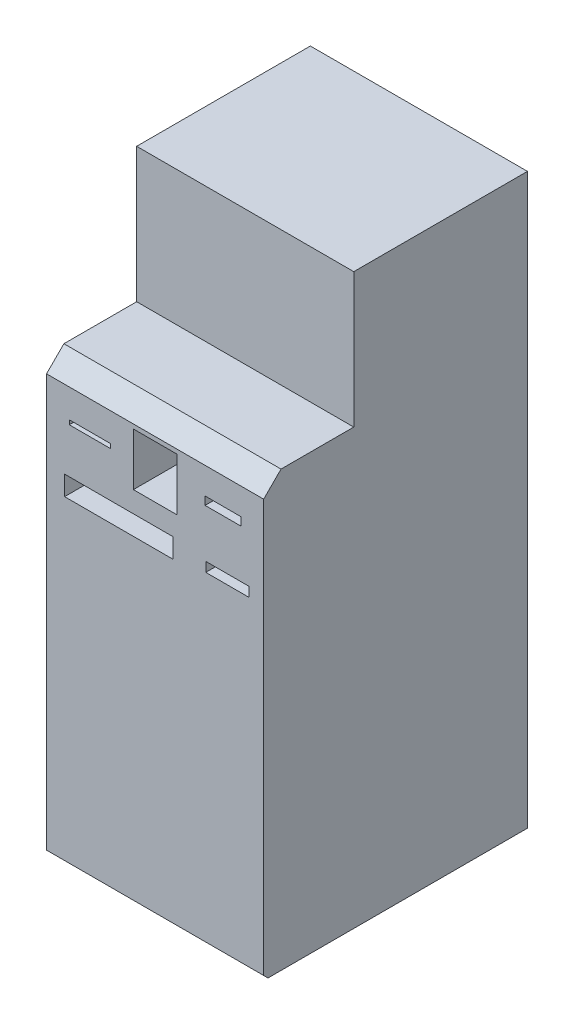
ISO-10303-21;
HEADER;
FILE_DESCRIPTION(('STEP AP214'),'2;1');
FILE_NAME('part.step','',(''),(''),'','','');
FILE_SCHEMA(('AUTOMOTIVE_DESIGN { 1 0 10303 214 1 1 1 1 }'));
ENDSEC;
DATA;
#1=APPLICATION_CONTEXT('core data for automotive mechanical design processes');
#2=APPLICATION_PROTOCOL_DEFINITION('international standard','automotive_design',2000,#1);
#3=PRODUCT_CONTEXT('',#1,'mechanical');
#4=PRODUCT('Part','Part','',(#3));
#5=PRODUCT_RELATED_PRODUCT_CATEGORY('part','',(#4));
#6=PRODUCT_DEFINITION_FORMATION('','',#4);
#7=PRODUCT_DEFINITION_CONTEXT('part definition',#1,'design');
#8=PRODUCT_DEFINITION('design','',#6,#7);
#9=PRODUCT_DEFINITION_SHAPE('','',#8);
#10=(LENGTH_UNIT() NAMED_UNIT(*) SI_UNIT(.MILLI.,.METRE.));
#11=(NAMED_UNIT(*) PLANE_ANGLE_UNIT() SI_UNIT($,.RADIAN.));
#12=(NAMED_UNIT(*) SI_UNIT($,.STERADIAN.) SOLID_ANGLE_UNIT());
#13=UNCERTAINTY_MEASURE_WITH_UNIT(LENGTH_MEASURE(1.E-05),#10,'distance_accuracy_value','');
#14=(GEOMETRIC_REPRESENTATION_CONTEXT(3) GLOBAL_UNCERTAINTY_ASSIGNED_CONTEXT((#13)) GLOBAL_UNIT_ASSIGNED_CONTEXT((#10,
#11,#12)) REPRESENTATION_CONTEXT('',''));
#15=CARTESIAN_POINT('',(0.,0.,0.));
#16=DIRECTION('',(0.,0.,1.));
#17=DIRECTION('',(1.,0.,0.));
#18=AXIS2_PLACEMENT_3D('',#15,#16,#17);
#19=CARTESIAN_POINT('',(500.,1000.,-407.526077778267));
#20=DIRECTION('',(0.,0.,1.));
#21=DIRECTION('',(0.,-1.,0.));
#22=AXIS2_PLACEMENT_3D('',#19,#20,#21);
#23=PLANE('',#22);
#24=DIRECTION('',(0.,1.,0.));
#25=VECTOR('',#24,1.);
#26=CARTESIAN_POINT('',(0.,1000.,-407.526077778267));
#27=LINE('',#26,#25);
#28=CARTESIAN_POINT('',(0.,0.,-407.526077778267));
#29=VERTEX_POINT('',#28);
#30=CARTESIAN_POINT('',(0.,1310.,-407.526077778267));
#31=VERTEX_POINT('',#30);
#32=EDGE_CURVE('E375',#29,#31,#27,.T.);
#33=ORIENTED_EDGE('',*,*,#32,.T.);
#34=DIRECTION('',(-1.,0.,0.));
#35=VECTOR('',#34,1.);
#36=CARTESIAN_POINT('',(500.,1310.,-407.526077778267));
#37=LINE('',#36,#35);
#38=CARTESIAN_POINT('',(500.,1310.,-407.526077778267));
#39=VERTEX_POINT('',#38);
#40=EDGE_CURVE('E40',#39,#31,#37,.T.);
#41=ORIENTED_EDGE('',*,*,#40,.F.);
#42=DIRECTION('',(0.,1.,0.));
#43=VECTOR('',#42,1.);
#44=CARTESIAN_POINT('',(500.,820.,-407.526077778267));
#45=LINE('',#44,#43);
#46=CARTESIAN_POINT('',(500.,0.,-407.526077778267));
#47=VERTEX_POINT('',#46);
#48=EDGE_CURVE('E385',#47,#39,#45,.T.);
#49=ORIENTED_EDGE('',*,*,#48,.F.);
#50=DIRECTION('',(-1.,0.,0.));
#51=VECTOR('',#50,1.);
#52=CARTESIAN_POINT('',(500.,0.,-407.526077778267));
#53=LINE('',#52,#51);
#54=EDGE_CURVE('E11',#47,#29,#53,.T.);
#55=ORIENTED_EDGE('',*,*,#54,.T.);
#56=EDGE_LOOP('',(#33,#41,#49,#55));
#57=FACE_BOUND('',#56,.T.);
#58=ADVANCED_FACE('F33',(#57),#23,.F.);
#59=CARTESIAN_POINT('',(500.,1310.,-7.52607777826703));
#60=DIRECTION('',(0.,-1.,0.));
#61=DIRECTION('',(0.,0.,-1.));
#62=AXIS2_PLACEMENT_3D('',#59,#60,#61);
#63=PLANE('',#62);
#64=DIRECTION('',(0.,0.,1.));
#65=VECTOR('',#64,1.);
#66=CARTESIAN_POINT('',(0.,1310.,-7.52607777826703));
#67=LINE('',#66,#65);
#68=CARTESIAN_POINT('',(0.,1310.,-7.52607777826703));
#69=VERTEX_POINT('',#68);
#70=EDGE_CURVE('E404',#31,#69,#67,.T.);
#71=ORIENTED_EDGE('',*,*,#70,.T.);
#72=DIRECTION('',(-1.,0.,0.));
#73=VECTOR('',#72,1.);
#74=CARTESIAN_POINT('',(500.,1310.,-7.52607777826703));
#75=LINE('',#74,#73);
#76=CARTESIAN_POINT('',(500.,1310.,-7.52607777826703));
#77=VERTEX_POINT('',#76);
#78=EDGE_CURVE('E432',#77,#69,#75,.T.);
#79=ORIENTED_EDGE('',*,*,#78,.F.);
#80=DIRECTION('',(0.,0.,1.));
#81=VECTOR('',#80,1.);
#82=CARTESIAN_POINT('',(500.,1310.,-407.526077778267));
#83=LINE('',#82,#81);
#84=EDGE_CURVE('E388',#39,#77,#83,.T.);
#85=ORIENTED_EDGE('',*,*,#84,.F.);
#86=ORIENTED_EDGE('',*,*,#40,.T.);
#87=EDGE_LOOP('',(#71,#79,#85,#86));
#88=FACE_BOUND('',#87,.T.);
#89=ADVANCED_FACE('F438',(#88),#63,.F.);
#90=CARTESIAN_POINT('',(500.,1000.,-7.52607777826703));
#91=DIRECTION('',(0.,0.,-1.));
#92=DIRECTION('',(-1.,0.,0.));
#93=AXIS2_PLACEMENT_3D('',#90,#91,#92);
#94=PLANE('',#93);
#95=DIRECTION('',(0.,-1.,0.));
#96=VECTOR('',#95,1.);
#97=CARTESIAN_POINT('',(0.,1000.,-7.52607777826703));
#98=LINE('',#97,#96);
#99=CARTESIAN_POINT('',(0.,1000.,-7.52607777826703));
#100=VERTEX_POINT('',#99);
#101=EDGE_CURVE('E406',#69,#100,#98,.T.);
#102=ORIENTED_EDGE('',*,*,#101,.T.);
#103=DIRECTION('',(-1.,0.,0.));
#104=VECTOR('',#103,1.);
#105=CARTESIAN_POINT('',(500.,1000.,-7.52607777826703));
#106=LINE('',#105,#104);
#107=CARTESIAN_POINT('',(500.,1000.,-7.52607777826703));
#108=VERTEX_POINT('',#107);
#109=EDGE_CURVE('E429',#108,#100,#106,.T.);
#110=ORIENTED_EDGE('',*,*,#109,.F.);
#111=DIRECTION('',(0.,-1.,0.));
#112=VECTOR('',#111,1.);
#113=CARTESIAN_POINT('',(500.,1000.,-7.52607777826703));
#114=LINE('',#113,#112);
#115=EDGE_CURVE('E390',#77,#108,#114,.T.);
#116=ORIENTED_EDGE('',*,*,#115,.F.);
#117=ORIENTED_EDGE('',*,*,#78,.T.);
#118=EDGE_LOOP('',(#102,#110,#116,#117));
#119=FACE_BOUND('',#118,.T.);
#120=ADVANCED_FACE('F470',(#119),#94,.F.);
#121=CARTESIAN_POINT('',(500.,1000.,160.));
#122=DIRECTION('',(0.,-1.,0.));
#123=DIRECTION('',(0.,0.,-1.));
#124=AXIS2_PLACEMENT_3D('',#121,#122,#123);
#125=PLANE('',#124);
#126=DIRECTION('',(0.,0.,1.));
#127=VECTOR('',#126,1.);
#128=CARTESIAN_POINT('',(0.,1000.,160.));
#129=LINE('',#128,#127);
#130=CARTESIAN_POINT('',(0.,1000.,160.));
#131=VERTEX_POINT('',#130);
#132=EDGE_CURVE('E408',#100,#131,#129,.T.);
#133=ORIENTED_EDGE('',*,*,#132,.T.);
#134=DIRECTION('',(-1.,0.,0.));
#135=VECTOR('',#134,1.);
#136=CARTESIAN_POINT('',(500.,1000.,160.));
#137=LINE('',#136,#135);
#138=CARTESIAN_POINT('',(500.,1000.,160.));
#139=VERTEX_POINT('',#138);
#140=EDGE_CURVE('E426',#139,#131,#137,.T.);
#141=ORIENTED_EDGE('',*,*,#140,.F.);
#142=DIRECTION('',(0.,0.,1.));
#143=VECTOR('',#142,1.);
#144=CARTESIAN_POINT('',(500.,1000.,160.));
#145=LINE('',#144,#143);
#146=EDGE_CURVE('E392',#108,#139,#145,.T.);
#147=ORIENTED_EDGE('',*,*,#146,.F.);
#148=ORIENTED_EDGE('',*,*,#109,.T.);
#149=EDGE_LOOP('',(#133,#141,#147,#148));
#150=FACE_BOUND('',#149,.T.);
#151=ADVANCED_FACE('F467',(#150),#125,.F.);
#152=CARTESIAN_POINT('',(500.,1000.,160.));
#153=DIRECTION('',(0.,-0.707106781186547,-0.707106781186548));
#154=DIRECTION('',(0.,0.707106781186548,-0.707106781186547));
#155=AXIS2_PLACEMENT_3D('',#152,#153,#154);
#156=PLANE('',#155);
#157=DIRECTION('',(0.,-0.707106781186548,0.707106781186547));
#158=VECTOR('',#157,1.);
#159=CARTESIAN_POINT('',(0.,1000.,160.));
#160=LINE('',#159,#158);
#161=CARTESIAN_POINT('',(0.,960.,200.));
#162=VERTEX_POINT('',#161);
#163=EDGE_CURVE('E410',#131,#162,#160,.T.);
#164=ORIENTED_EDGE('',*,*,#163,.T.);
#165=DIRECTION('',(-1.,0.,0.));
#166=VECTOR('',#165,1.);
#167=CARTESIAN_POINT('',(500.,960.,200.));
#168=LINE('',#167,#166);
#169=CARTESIAN_POINT('',(500.,960.,200.));
#170=VERTEX_POINT('',#169);
#171=EDGE_CURVE('E423',#170,#162,#168,.T.);
#172=ORIENTED_EDGE('',*,*,#171,.F.);
#173=DIRECTION('',(0.,-0.707106781186548,0.707106781186547));
#174=VECTOR('',#173,1.);
#175=CARTESIAN_POINT('',(500.,1000.,160.));
#176=LINE('',#175,#174);
#177=EDGE_CURVE('E394',#139,#170,#176,.T.);
#178=ORIENTED_EDGE('',*,*,#177,.F.);
#179=ORIENTED_EDGE('',*,*,#140,.T.);
#180=EDGE_LOOP('',(#164,#172,#178,#179));
#181=FACE_BOUND('',#180,.T.);
#182=ADVANCED_FACE('F463',(#181),#156,.F.);
#183=CARTESIAN_POINT('',(500.,9.99999999999998,200.));
#184=DIRECTION('',(0.,0.,-1.));
#185=DIRECTION('',(-1.,0.,0.));
#186=AXIS2_PLACEMENT_3D('',#183,#184,#185);
#187=PLANE('',#186);
#188=DIRECTION('',(1.,0.,0.));
#189=VECTOR('',#188,1.);
#190=CARTESIAN_POINT('',(366.666666666667,747.294000625917,200.));
#191=LINE('',#190,#189);
#192=CARTESIAN_POINT('',(366.666666666667,747.294000625917,200.));
#193=VERTEX_POINT('',#192);
#194=CARTESIAN_POINT('',(466.666666666667,747.294000625917,200.));
#195=VERTEX_POINT('',#194);
#196=EDGE_CURVE('E272',#193,#195,#191,.T.);
#197=ORIENTED_EDGE('',*,*,#196,.F.);
#198=DIRECTION('',(0.,-1.,0.));
#199=VECTOR('',#198,1.);
#200=CARTESIAN_POINT('',(366.666666666667,747.294000625917,200.));
#201=LINE('',#200,#199);
#202=CARTESIAN_POINT('',(366.666666666667,769.294000625917,200.));
#203=VERTEX_POINT('',#202);
#204=EDGE_CURVE('E47',#203,#193,#201,.T.);
#205=ORIENTED_EDGE('',*,*,#204,.F.);
#206=DIRECTION('',(-1.,0.,0.));
#207=VECTOR('',#206,1.);
#208=CARTESIAN_POINT('',(366.666666666667,769.294000625917,200.));
#209=LINE('',#208,#207);
#210=CARTESIAN_POINT('',(466.666666666667,769.294000625917,200.));
#211=VERTEX_POINT('',#210);
#212=EDGE_CURVE('E261',#211,#203,#209,.T.);
#213=ORIENTED_EDGE('',*,*,#212,.F.);
#214=DIRECTION('',(0.,1.,0.));
#215=VECTOR('',#214,1.);
#216=CARTESIAN_POINT('',(466.666666666667,747.294000625917,200.));
#217=LINE('',#216,#215);
#218=EDGE_CURVE('E275',#195,#211,#217,.T.);
#219=ORIENTED_EDGE('',*,*,#218,.F.);
#220=EDGE_LOOP('',(#197,#205,#213,#219));
#221=FACE_BOUND('',#220,.T.);
#222=DIRECTION('',(-1.,0.,0.));
#223=VECTOR('',#222,1.);
#224=CARTESIAN_POINT('',(147.65,894.5,200.));
#225=LINE('',#224,#223);
#226=CARTESIAN_POINT('',(147.65,894.5,200.));
#227=VERTEX_POINT('',#226);
#228=CARTESIAN_POINT('',(52.35,894.5,200.));
#229=VERTEX_POINT('',#228);
#230=EDGE_CURVE('E246',#227,#229,#225,.T.);
#231=ORIENTED_EDGE('',*,*,#230,.F.);
#232=DIRECTION('',(0.,1.,0.));
#233=VECTOR('',#232,1.);
#234=CARTESIAN_POINT('',(147.65,894.5,200.));
#235=LINE('',#234,#233);
#236=CARTESIAN_POINT('',(147.65,884.5,200.));
#237=VERTEX_POINT('',#236);
#238=EDGE_CURVE('E55',#237,#227,#235,.T.);
#239=ORIENTED_EDGE('',*,*,#238,.F.);
#240=DIRECTION('',(1.,0.,0.));
#241=VECTOR('',#240,1.);
#242=CARTESIAN_POINT('',(147.65,884.5,200.));
#243=LINE('',#242,#241);
#244=CARTESIAN_POINT('',(52.35,884.5,200.));
#245=VERTEX_POINT('',#244);
#246=EDGE_CURVE('E237',#245,#237,#243,.T.);
#247=ORIENTED_EDGE('',*,*,#246,.F.);
#248=DIRECTION('',(0.,-1.,0.));
#249=VECTOR('',#248,1.);
#250=CARTESIAN_POINT('',(52.35,894.5,200.));
#251=LINE('',#250,#249);
#252=EDGE_CURVE('E240',#229,#245,#251,.T.);
#253=ORIENTED_EDGE('',*,*,#252,.F.);
#254=EDGE_LOOP('',(#231,#239,#247,#253));
#255=FACE_BOUND('',#254,.T.);
#256=DIRECTION('',(1.,0.,0.));
#257=VECTOR('',#256,1.);
#258=CARTESIAN_POINT('',(365.11,880.1,200.));
#259=LINE('',#258,#257);
#260=CARTESIAN_POINT('',(365.11,880.1,200.));
#261=VERTEX_POINT('',#260);
#262=CARTESIAN_POINT('',(447.65,880.1,200.));
#263=VERTEX_POINT('',#262);
#264=EDGE_CURVE('E335',#261,#263,#259,.T.);
#265=ORIENTED_EDGE('',*,*,#264,.F.);
#266=DIRECTION('',(0.,-1.,0.));
#267=VECTOR('',#266,1.);
#268=CARTESIAN_POINT('',(365.11,898.9,200.));
#269=LINE('',#268,#267);
#270=CARTESIAN_POINT('',(365.11,898.9,200.));
#271=VERTEX_POINT('',#270);
#272=EDGE_CURVE('E253',#271,#261,#269,.T.);
#273=ORIENTED_EDGE('',*,*,#272,.F.);
#274=DIRECTION('',(-1.,0.,0.));
#275=VECTOR('',#274,1.);
#276=CARTESIAN_POINT('',(365.11,898.9,200.));
#277=LINE('',#276,#275);
#278=CARTESIAN_POINT('',(447.65,898.9,200.));
#279=VERTEX_POINT('',#278);
#280=EDGE_CURVE('E324',#279,#271,#277,.T.);
#281=ORIENTED_EDGE('',*,*,#280,.F.);
#282=DIRECTION('',(0.,1.,0.));
#283=VECTOR('',#282,1.);
#284=CARTESIAN_POINT('',(447.65,898.9,200.));
#285=LINE('',#284,#283);
#286=EDGE_CURVE('E338',#263,#279,#285,.T.);
#287=ORIENTED_EDGE('',*,*,#286,.F.);
#288=EDGE_LOOP('',(#265,#273,#281,#287));
#289=FACE_BOUND('',#288,.T.);
#290=DIRECTION('',(1.,0.,0.));
#291=VECTOR('',#290,1.);
#292=CARTESIAN_POINT('',(41.6666666666668,735.794000625917,200.));
#293=LINE('',#292,#291);
#294=CARTESIAN_POINT('',(41.6666666666668,735.794000625917,200.));
#295=VERTEX_POINT('',#294);
#296=CARTESIAN_POINT('',(291.666666666667,735.794000625917,200.));
#297=VERTEX_POINT('',#296);
#298=EDGE_CURVE('E302',#295,#297,#293,.T.);
#299=ORIENTED_EDGE('',*,*,#298,.F.);
#300=DIRECTION('',(0.,-1.,0.));
#301=VECTOR('',#300,1.);
#302=CARTESIAN_POINT('',(41.6666666666668,780.794000625917,200.));
#303=LINE('',#302,#301);
#304=CARTESIAN_POINT('',(41.6666666666668,780.794000625917,200.));
#305=VERTEX_POINT('',#304);
#306=EDGE_CURVE('E300',#305,#295,#303,.T.);
#307=ORIENTED_EDGE('',*,*,#306,.F.);
#308=DIRECTION('',(-1.,0.,0.));
#309=VECTOR('',#308,1.);
#310=CARTESIAN_POINT('',(41.6666666666668,780.794000625917,200.));
#311=LINE('',#310,#309);
#312=CARTESIAN_POINT('',(291.666666666667,780.794000625917,200.));
#313=VERTEX_POINT('',#312);
#314=EDGE_CURVE('E290',#313,#305,#311,.T.);
#315=ORIENTED_EDGE('',*,*,#314,.F.);
#316=DIRECTION('',(0.,1.,0.));
#317=VECTOR('',#316,1.);
#318=CARTESIAN_POINT('',(291.666666666667,780.794000625917,200.));
#319=LINE('',#318,#317);
#320=EDGE_CURVE('E306',#297,#313,#319,.T.);
#321=ORIENTED_EDGE('',*,*,#320,.F.);
#322=EDGE_LOOP('',(#299,#307,#315,#321));
#323=FACE_BOUND('',#322,.T.);
#324=DIRECTION('',(1.,0.,0.));
#325=VECTOR('',#324,1.);
#326=CARTESIAN_POINT('',(200.,829.,200.));
#327=LINE('',#326,#325);
#328=CARTESIAN_POINT('',(200.,829.,200.));
#329=VERTEX_POINT('',#328);
#330=CARTESIAN_POINT('',(300.,829.,200.));
#331=VERTEX_POINT('',#330);
#332=EDGE_CURVE('E365',#329,#331,#327,.T.);
#333=ORIENTED_EDGE('',*,*,#332,.F.);
#334=DIRECTION('',(0.,-1.,0.));
#335=VECTOR('',#334,1.);
#336=CARTESIAN_POINT('',(200.,950.,200.));
#337=LINE('',#336,#335);
#338=CARTESIAN_POINT('',(200.,950.,200.));
#339=VERTEX_POINT('',#338);
#340=EDGE_CURVE('E313',#339,#329,#337,.T.);
#341=ORIENTED_EDGE('',*,*,#340,.F.);
#342=DIRECTION('',(-1.,0.,0.));
#343=VECTOR('',#342,1.);
#344=CARTESIAN_POINT('',(200.,950.,200.));
#345=LINE('',#344,#343);
#346=CARTESIAN_POINT('',(300.,950.,200.));
#347=VERTEX_POINT('',#346);
#348=EDGE_CURVE('E354',#347,#339,#345,.T.);
#349=ORIENTED_EDGE('',*,*,#348,.F.);
#350=DIRECTION('',(0.,1.,0.));
#351=VECTOR('',#350,1.);
#352=CARTESIAN_POINT('',(300.,950.,200.));
#353=LINE('',#352,#351);
#354=EDGE_CURVE('E368',#331,#347,#353,.T.);
#355=ORIENTED_EDGE('',*,*,#354,.F.);
#356=EDGE_LOOP('',(#333,#341,#349,#355));
#357=FACE_BOUND('',#356,.T.);
#358=DIRECTION('',(0.,-1.,0.));
#359=VECTOR('',#358,1.);
#360=CARTESIAN_POINT('',(0.,9.99999999999998,200.));
#361=LINE('',#360,#359);
#362=CARTESIAN_POINT('',(0.,9.99999999999998,200.));
#363=VERTEX_POINT('',#362);
#364=EDGE_CURVE('E412',#162,#363,#361,.T.);
#365=ORIENTED_EDGE('',*,*,#364,.T.);
#366=DIRECTION('',(-1.,0.,0.));
#367=VECTOR('',#366,1.);
#368=CARTESIAN_POINT('',(500.,9.99999999999998,200.));
#369=LINE('',#368,#367);
#370=CARTESIAN_POINT('',(500.,9.99999999999998,200.));
#371=VERTEX_POINT('',#370);
#372=EDGE_CURVE('E420',#371,#363,#369,.T.);
#373=ORIENTED_EDGE('',*,*,#372,.F.);
#374=DIRECTION('',(0.,-1.,0.));
#375=VECTOR('',#374,1.);
#376=CARTESIAN_POINT('',(500.,9.99999999999998,200.));
#377=LINE('',#376,#375);
#378=EDGE_CURVE('E396',#170,#371,#377,.T.);
#379=ORIENTED_EDGE('',*,*,#378,.F.);
#380=ORIENTED_EDGE('',*,*,#171,.T.);
#381=EDGE_LOOP('',(#365,#373,#379,#380));
#382=FACE_BOUND('',#381,.T.);
#383=ADVANCED_FACE('F458',(#221,#255,#289,#323,#357,#382),#187,.F.);
#384=CARTESIAN_POINT('',(500.,0.,190.));
#385=DIRECTION('',(0.,0.707106781186548,-0.707106781186547));
#386=DIRECTION('',(0.,0.707106781186547,0.707106781186548));
#387=AXIS2_PLACEMENT_3D('',#384,#385,#386);
#388=PLANE('',#387);
#389=DIRECTION('',(0.,-0.707106781186547,-0.707106781186548));
#390=VECTOR('',#389,1.);
#391=CARTESIAN_POINT('',(0.,0.,190.));
#392=LINE('',#391,#390);
#393=CARTESIAN_POINT('',(0.,0.,190.));
#394=VERTEX_POINT('',#393);
#395=EDGE_CURVE('E414',#363,#394,#392,.T.);
#396=ORIENTED_EDGE('',*,*,#395,.T.);
#397=DIRECTION('',(-1.,0.,0.));
#398=VECTOR('',#397,1.);
#399=CARTESIAN_POINT('',(500.,0.,190.));
#400=LINE('',#399,#398);
#401=CARTESIAN_POINT('',(500.,0.,190.));
#402=VERTEX_POINT('',#401);
#403=EDGE_CURVE('E401',#402,#394,#400,.T.);
#404=ORIENTED_EDGE('',*,*,#403,.F.);
#405=DIRECTION('',(0.,-0.707106781186547,-0.707106781186548));
#406=VECTOR('',#405,1.);
#407=CARTESIAN_POINT('',(500.,0.,190.));
#408=LINE('',#407,#406);
#409=EDGE_CURVE('E398',#371,#402,#408,.T.);
#410=ORIENTED_EDGE('',*,*,#409,.F.);
#411=ORIENTED_EDGE('',*,*,#372,.T.);
#412=EDGE_LOOP('',(#396,#404,#410,#411));
#413=FACE_BOUND('',#412,.T.);
#414=ADVANCED_FACE('F452',(#413),#388,.F.);
#415=CARTESIAN_POINT('',(500.,0.,0.));
#416=DIRECTION('',(0.,1.,0.));
#417=DIRECTION('',(0.,0.,1.));
#418=AXIS2_PLACEMENT_3D('',#415,#416,#417);
#419=PLANE('',#418);
#420=DIRECTION('',(0.,0.,-1.));
#421=VECTOR('',#420,1.);
#422=CARTESIAN_POINT('',(0.,0.,0.));
#423=LINE('',#422,#421);
#424=EDGE_CURVE('E386',#394,#29,#423,.T.);
#425=ORIENTED_EDGE('',*,*,#424,.T.);
#426=ORIENTED_EDGE('',*,*,#54,.F.);
#427=DIRECTION('',(0.,0.,-1.));
#428=VECTOR('',#427,1.);
#429=CARTESIAN_POINT('',(500.,0.,-407.526077778267));
#430=LINE('',#429,#428);
#431=EDGE_CURVE('E382',#402,#47,#430,.T.);
#432=ORIENTED_EDGE('',*,*,#431,.F.);
#433=ORIENTED_EDGE('',*,*,#403,.T.);
#434=EDGE_LOOP('',(#425,#426,#432,#433));
#435=FACE_BOUND('',#434,.T.);
#436=ADVANCED_FACE('F448',(#435),#419,.F.);
#437=CARTESIAN_POINT('',(500.,0.,0.));
#438=DIRECTION('',(-1.,0.,0.));
#439=DIRECTION('',(0.,0.,1.));
#440=AXIS2_PLACEMENT_3D('',#437,#438,#439);
#441=PLANE('',#440);
#442=ORIENTED_EDGE('',*,*,#431,.T.);
#443=ORIENTED_EDGE('',*,*,#48,.T.);
#444=ORIENTED_EDGE('',*,*,#84,.T.);
#445=ORIENTED_EDGE('',*,*,#115,.T.);
#446=ORIENTED_EDGE('',*,*,#146,.T.);
#447=ORIENTED_EDGE('',*,*,#177,.T.);
#448=ORIENTED_EDGE('',*,*,#378,.T.);
#449=ORIENTED_EDGE('',*,*,#409,.T.);
#450=EDGE_LOOP('',(#442,#443,#444,#445,#446,#447,#448,#449));
#451=FACE_BOUND('',#450,.T.);
#452=ADVANCED_FACE('F473',(#451),#441,.F.);
#453=CARTESIAN_POINT('',(0.,0.,0.));
#454=DIRECTION('',(-1.,0.,0.));
#455=DIRECTION('',(0.,0.,1.));
#456=AXIS2_PLACEMENT_3D('',#453,#454,#455);
#457=PLANE('',#456);
#458=ORIENTED_EDGE('',*,*,#32,.F.);
#459=ORIENTED_EDGE('',*,*,#424,.F.);
#460=ORIENTED_EDGE('',*,*,#395,.F.);
#461=ORIENTED_EDGE('',*,*,#364,.F.);
#462=ORIENTED_EDGE('',*,*,#163,.F.);
#463=ORIENTED_EDGE('',*,*,#132,.F.);
#464=ORIENTED_EDGE('',*,*,#101,.F.);
#465=ORIENTED_EDGE('',*,*,#70,.F.);
#466=EDGE_LOOP('',(#458,#459,#460,#461,#462,#463,#464,#465));
#467=FACE_BOUND('',#466,.T.);
#468=ADVANCED_FACE('F444',(#467),#457,.T.);
#469=CARTESIAN_POINT('',(200.,950.,-68.0000000000001));
#470=DIRECTION('',(-1.,0.,0.));
#471=DIRECTION('',(0.,0.,1.));
#472=AXIS2_PLACEMENT_3D('',#469,#470,#471);
#473=PLANE('',#472);
#474=ORIENTED_EDGE('',*,*,#340,.T.);
#475=DIRECTION('',(0.,0.,1.));
#476=VECTOR('',#475,1.);
#477=CARTESIAN_POINT('',(200.,829.,-68.0000000000001));
#478=LINE('',#477,#476);
#479=CARTESIAN_POINT('',(200.,829.,-68.0000000000001));
#480=VERTEX_POINT('',#479);
#481=EDGE_CURVE('E363',#480,#329,#478,.T.);
#482=ORIENTED_EDGE('',*,*,#481,.F.);
#483=DIRECTION('',(0.,-1.,0.));
#484=VECTOR('',#483,1.);
#485=CARTESIAN_POINT('',(200.,950.,-68.0000000000001));
#486=LINE('',#485,#484);
#487=CARTESIAN_POINT('',(200.,950.,-68.0000000000001));
#488=VERTEX_POINT('',#487);
#489=EDGE_CURVE('E350',#488,#480,#486,.T.);
#490=ORIENTED_EDGE('',*,*,#489,.F.);
#491=DIRECTION('',(0.,0.,1.));
#492=VECTOR('',#491,1.);
#493=CARTESIAN_POINT('',(200.,950.,-68.0000000000001));
#494=LINE('',#493,#492);
#495=EDGE_CURVE('E373',#488,#339,#494,.T.);
#496=ORIENTED_EDGE('',*,*,#495,.T.);
#497=EDGE_LOOP('',(#474,#482,#490,#496));
#498=FACE_BOUND('',#497,.T.);
#499=ADVANCED_FACE('F480',(#498),#473,.F.);
#500=CARTESIAN_POINT('',(200.,950.,-68.0000000000001));
#501=DIRECTION('',(0.,1.,0.));
#502=DIRECTION('',(0.,0.,1.));
#503=AXIS2_PLACEMENT_3D('',#500,#501,#502);
#504=PLANE('',#503);
#505=ORIENTED_EDGE('',*,*,#348,.T.);
#506=ORIENTED_EDGE('',*,*,#495,.F.);
#507=DIRECTION('',(-1.,0.,0.));
#508=VECTOR('',#507,1.);
#509=CARTESIAN_POINT('',(200.,950.,-68.0000000000001));
#510=LINE('',#509,#508);
#511=CARTESIAN_POINT('',(300.,950.,-68.0000000000001));
#512=VERTEX_POINT('',#511);
#513=EDGE_CURVE('E360',#512,#488,#510,.T.);
#514=ORIENTED_EDGE('',*,*,#513,.F.);
#515=DIRECTION('',(0.,0.,1.));
#516=VECTOR('',#515,1.);
#517=CARTESIAN_POINT('',(300.,950.,-68.0000000000001));
#518=LINE('',#517,#516);
#519=EDGE_CURVE('E376',#512,#347,#518,.T.);
#520=ORIENTED_EDGE('',*,*,#519,.T.);
#521=EDGE_LOOP('',(#505,#506,#514,#520));
#522=FACE_BOUND('',#521,.T.);
#523=ADVANCED_FACE('F535',(#522),#504,.F.);
#524=CARTESIAN_POINT('',(300.,950.,-68.0000000000001));
#525=DIRECTION('',(1.,0.,0.));
#526=DIRECTION('',(0.,1.,0.));
#527=AXIS2_PLACEMENT_3D('',#524,#525,#526);
#528=PLANE('',#527);
#529=ORIENTED_EDGE('',*,*,#354,.T.);
#530=ORIENTED_EDGE('',*,*,#519,.F.);
#531=DIRECTION('',(0.,1.,0.));
#532=VECTOR('',#531,1.);
#533=CARTESIAN_POINT('',(300.,950.,-68.0000000000001));
#534=LINE('',#533,#532);
#535=CARTESIAN_POINT('',(300.,829.,-68.0000000000001));
#536=VERTEX_POINT('',#535);
#537=EDGE_CURVE('E357',#536,#512,#534,.T.);
#538=ORIENTED_EDGE('',*,*,#537,.F.);
#539=DIRECTION('',(0.,0.,1.));
#540=VECTOR('',#539,1.);
#541=CARTESIAN_POINT('',(300.,829.,-68.0000000000001));
#542=LINE('',#541,#540);
#543=EDGE_CURVE('E378',#536,#331,#542,.T.);
#544=ORIENTED_EDGE('',*,*,#543,.T.);
#545=EDGE_LOOP('',(#529,#530,#538,#544));
#546=FACE_BOUND('',#545,.T.);
#547=ADVANCED_FACE('F544',(#546),#528,.F.);
#548=CARTESIAN_POINT('',(200.,829.,-68.0000000000001));
#549=DIRECTION('',(0.,-1.,0.));
#550=DIRECTION('',(0.,0.,-1.));
#551=AXIS2_PLACEMENT_3D('',#548,#549,#550);
#552=PLANE('',#551);
#553=ORIENTED_EDGE('',*,*,#332,.T.);
#554=ORIENTED_EDGE('',*,*,#543,.F.);
#555=DIRECTION('',(1.,0.,0.));
#556=VECTOR('',#555,1.);
#557=CARTESIAN_POINT('',(200.,829.,-68.0000000000001));
#558=LINE('',#557,#556);
#559=EDGE_CURVE('E353',#480,#536,#558,.T.);
#560=ORIENTED_EDGE('',*,*,#559,.F.);
#561=ORIENTED_EDGE('',*,*,#481,.T.);
#562=EDGE_LOOP('',(#553,#554,#560,#561));
#563=FACE_BOUND('',#562,.T.);
#564=ADVANCED_FACE('F554',(#563),#552,.F.);
#565=CARTESIAN_POINT('',(0.,0.,-68.0000000000001));
#566=DIRECTION('',(0.,0.,1.));
#567=DIRECTION('',(1.,0.,0.));
#568=AXIS2_PLACEMENT_3D('',#565,#566,#567);
#569=PLANE('',#568);
#570=ORIENTED_EDGE('',*,*,#489,.T.);
#571=ORIENTED_EDGE('',*,*,#559,.T.);
#572=ORIENTED_EDGE('',*,*,#537,.T.);
#573=ORIENTED_EDGE('',*,*,#513,.T.);
#574=EDGE_LOOP('',(#570,#571,#572,#573));
#575=FACE_BOUND('',#574,.T.);
#576=ADVANCED_FACE('F564',(#575),#569,.T.);
#577=CARTESIAN_POINT('',(41.6666666666668,780.794000625917,-68.0000000000001));
#578=DIRECTION('',(-1.,0.,0.));
#579=DIRECTION('',(0.,0.,1.));
#580=AXIS2_PLACEMENT_3D('',#577,#578,#579);
#581=PLANE('',#580);
#582=ORIENTED_EDGE('',*,*,#306,.T.);
#583=DIRECTION('',(0.,0.,1.));
#584=VECTOR('',#583,1.);
#585=CARTESIAN_POINT('',(41.6666666666668,735.794000625917,-68.0000000000001));
#586=LINE('',#585,#584);
#587=CARTESIAN_POINT('',(41.6666666666668,735.794000625917,-68.0000000000001));
#588=VERTEX_POINT('',#587);
#589=EDGE_CURVE('E299',#588,#295,#586,.T.);
#590=ORIENTED_EDGE('',*,*,#589,.F.);
#591=DIRECTION('',(0.,-1.,0.));
#592=VECTOR('',#591,1.);
#593=CARTESIAN_POINT('',(41.6666666666668,780.794000625917,-68.0000000000001));
#594=LINE('',#593,#592);
#595=CARTESIAN_POINT('',(41.6666666666668,780.794000625917,-68.0000000000001));
#596=VERTEX_POINT('',#595);
#597=EDGE_CURVE('E286',#596,#588,#594,.T.);
#598=ORIENTED_EDGE('',*,*,#597,.F.);
#599=DIRECTION('',(0.,0.,1.));
#600=VECTOR('',#599,1.);
#601=CARTESIAN_POINT('',(41.6666666666668,780.794000625917,-68.0000000000001));
#602=LINE('',#601,#600);
#603=EDGE_CURVE('E311',#596,#305,#602,.T.);
#604=ORIENTED_EDGE('',*,*,#603,.T.);
#605=EDGE_LOOP('',(#582,#590,#598,#604));
#606=FACE_BOUND('',#605,.T.);
#607=ADVANCED_FACE('F574',(#606),#581,.F.);
#608=CARTESIAN_POINT('',(41.6666666666668,780.794000625917,-68.0000000000001));
#609=DIRECTION('',(0.,1.,0.));
#610=DIRECTION('',(-1.,0.,0.));
#611=AXIS2_PLACEMENT_3D('',#608,#609,#610);
#612=PLANE('',#611);
#613=ORIENTED_EDGE('',*,*,#314,.T.);
#614=ORIENTED_EDGE('',*,*,#603,.F.);
#615=DIRECTION('',(-1.,0.,0.));
#616=VECTOR('',#615,1.);
#617=CARTESIAN_POINT('',(41.6666666666668,780.794000625917,-68.0000000000001));
#618=LINE('',#617,#616);
#619=CARTESIAN_POINT('',(291.666666666667,780.794000625917,-68.0000000000001));
#620=VERTEX_POINT('',#619);
#621=EDGE_CURVE('E296',#620,#596,#618,.T.);
#622=ORIENTED_EDGE('',*,*,#621,.F.);
#623=DIRECTION('',(0.,0.,1.));
#624=VECTOR('',#623,1.);
#625=CARTESIAN_POINT('',(291.666666666667,780.794000625917,-68.0000000000001));
#626=LINE('',#625,#624);
#627=EDGE_CURVE('E314',#620,#313,#626,.T.);
#628=ORIENTED_EDGE('',*,*,#627,.T.);
#629=EDGE_LOOP('',(#613,#614,#622,#628));
#630=FACE_BOUND('',#629,.T.);
#631=ADVANCED_FACE('F584',(#630),#612,.F.);
#632=CARTESIAN_POINT('',(291.666666666667,780.794000625917,-68.0000000000001));
#633=DIRECTION('',(1.,0.,0.));
#634=DIRECTION('',(0.,0.,-1.));
#635=AXIS2_PLACEMENT_3D('',#632,#633,#634);
#636=PLANE('',#635);
#637=ORIENTED_EDGE('',*,*,#320,.T.);
#638=ORIENTED_EDGE('',*,*,#627,.F.);
#639=DIRECTION('',(0.,1.,0.));
#640=VECTOR('',#639,1.);
#641=CARTESIAN_POINT('',(291.666666666667,780.794000625917,-68.0000000000001));
#642=LINE('',#641,#640);
#643=CARTESIAN_POINT('',(291.666666666667,735.794000625917,-68.0000000000001));
#644=VERTEX_POINT('',#643);
#645=EDGE_CURVE('E293',#644,#620,#642,.T.);
#646=ORIENTED_EDGE('',*,*,#645,.F.);
#647=DIRECTION('',(0.,0.,1.));
#648=VECTOR('',#647,1.);
#649=CARTESIAN_POINT('',(291.666666666667,735.794000625917,-68.0000000000001));
#650=LINE('',#649,#648);
#651=EDGE_CURVE('E316',#644,#297,#650,.T.);
#652=ORIENTED_EDGE('',*,*,#651,.T.);
#653=EDGE_LOOP('',(#637,#638,#646,#652));
#654=FACE_BOUND('',#653,.T.);
#655=ADVANCED_FACE('F594',(#654),#636,.F.);
#656=CARTESIAN_POINT('',(41.6666666666668,735.794000625917,-68.0000000000001));
#657=DIRECTION('',(0.,-1.,0.));
#658=DIRECTION('',(1.,0.,0.));
#659=AXIS2_PLACEMENT_3D('',#656,#657,#658);
#660=PLANE('',#659);
#661=ORIENTED_EDGE('',*,*,#298,.T.);
#662=ORIENTED_EDGE('',*,*,#651,.F.);
#663=DIRECTION('',(1.,0.,0.));
#664=VECTOR('',#663,1.);
#665=CARTESIAN_POINT('',(41.6666666666668,735.794000625917,-68.0000000000001));
#666=LINE('',#665,#664);
#667=EDGE_CURVE('E289',#588,#644,#666,.T.);
#668=ORIENTED_EDGE('',*,*,#667,.F.);
#669=ORIENTED_EDGE('',*,*,#589,.T.);
#670=EDGE_LOOP('',(#661,#662,#668,#669));
#671=FACE_BOUND('',#670,.T.);
#672=ADVANCED_FACE('F604',(#671),#660,.F.);
#673=CARTESIAN_POINT('',(0.,0.,-68.0000000000001));
#674=DIRECTION('',(0.,0.,1.));
#675=DIRECTION('',(1.,0.,0.));
#676=AXIS2_PLACEMENT_3D('',#673,#674,#675);
#677=PLANE('',#676);
#678=ORIENTED_EDGE('',*,*,#597,.T.);
#679=ORIENTED_EDGE('',*,*,#667,.T.);
#680=ORIENTED_EDGE('',*,*,#645,.T.);
#681=ORIENTED_EDGE('',*,*,#621,.T.);
#682=EDGE_LOOP('',(#678,#679,#680,#681));
#683=FACE_BOUND('',#682,.T.);
#684=ADVANCED_FACE('F614',(#683),#677,.T.);
#685=CARTESIAN_POINT('',(365.11,898.9,-68.0000000000001));
#686=DIRECTION('',(-1.,0.,0.));
#687=DIRECTION('',(0.,0.,1.));
#688=AXIS2_PLACEMENT_3D('',#685,#686,#687);
#689=PLANE('',#688);
#690=ORIENTED_EDGE('',*,*,#272,.T.);
#691=DIRECTION('',(0.,0.,1.));
#692=VECTOR('',#691,1.);
#693=CARTESIAN_POINT('',(365.11,880.1,-68.0000000000001));
#694=LINE('',#693,#692);
#695=CARTESIAN_POINT('',(365.11,880.1,-68.0000000000001));
#696=VERTEX_POINT('',#695);
#697=EDGE_CURVE('E333',#696,#261,#694,.T.);
#698=ORIENTED_EDGE('',*,*,#697,.F.);
#699=DIRECTION('',(0.,-1.,0.));
#700=VECTOR('',#699,1.);
#701=CARTESIAN_POINT('',(365.11,898.9,-68.0000000000001));
#702=LINE('',#701,#700);
#703=CARTESIAN_POINT('',(365.11,898.9,-68.0000000000001));
#704=VERTEX_POINT('',#703);
#705=EDGE_CURVE('E320',#704,#696,#702,.T.);
#706=ORIENTED_EDGE('',*,*,#705,.F.);
#707=DIRECTION('',(0.,0.,1.));
#708=VECTOR('',#707,1.);
#709=CARTESIAN_POINT('',(365.11,898.9,-68.0000000000001));
#710=LINE('',#709,#708);
#711=EDGE_CURVE('E303',#704,#271,#710,.T.);
#712=ORIENTED_EDGE('',*,*,#711,.T.);
#713=EDGE_LOOP('',(#690,#698,#706,#712));
#714=FACE_BOUND('',#713,.T.);
#715=ADVANCED_FACE('F624',(#714),#689,.F.);
#716=CARTESIAN_POINT('',(365.11,898.9,-68.0000000000001));
#717=DIRECTION('',(0.,1.,0.));
#718=DIRECTION('',(-1.,0.,0.));
#719=AXIS2_PLACEMENT_3D('',#716,#717,#718);
#720=PLANE('',#719);
#721=ORIENTED_EDGE('',*,*,#280,.T.);
#722=ORIENTED_EDGE('',*,*,#711,.F.);
#723=DIRECTION('',(-1.,0.,0.));
#724=VECTOR('',#723,1.);
#725=CARTESIAN_POINT('',(365.11,898.9,-68.0000000000001));
#726=LINE('',#725,#724);
#727=CARTESIAN_POINT('',(447.65,898.9,-68.0000000000001));
#728=VERTEX_POINT('',#727);
#729=EDGE_CURVE('E330',#728,#704,#726,.T.);
#730=ORIENTED_EDGE('',*,*,#729,.F.);
#731=DIRECTION('',(0.,0.,1.));
#732=VECTOR('',#731,1.);
#733=CARTESIAN_POINT('',(447.65,898.9,-68.0000000000001));
#734=LINE('',#733,#732);
#735=EDGE_CURVE('E344',#728,#279,#734,.T.);
#736=ORIENTED_EDGE('',*,*,#735,.T.);
#737=EDGE_LOOP('',(#721,#722,#730,#736));
#738=FACE_BOUND('',#737,.T.);
#739=ADVANCED_FACE('F634',(#738),#720,.F.);
#740=CARTESIAN_POINT('',(447.65,898.9,-68.0000000000001));
#741=DIRECTION('',(1.,0.,0.));
#742=DIRECTION('',(0.,0.,-1.));
#743=AXIS2_PLACEMENT_3D('',#740,#741,#742);
#744=PLANE('',#743);
#745=ORIENTED_EDGE('',*,*,#286,.T.);
#746=ORIENTED_EDGE('',*,*,#735,.F.);
#747=DIRECTION('',(0.,1.,0.));
#748=VECTOR('',#747,1.);
#749=CARTESIAN_POINT('',(447.65,898.9,-68.0000000000001));
#750=LINE('',#749,#748);
#751=CARTESIAN_POINT('',(447.65,880.1,-68.0000000000001));
#752=VERTEX_POINT('',#751);
#753=EDGE_CURVE('E327',#752,#728,#750,.T.);
#754=ORIENTED_EDGE('',*,*,#753,.F.);
#755=DIRECTION('',(0.,0.,1.));
#756=VECTOR('',#755,1.);
#757=CARTESIAN_POINT('',(447.65,880.1,-68.0000000000001));
#758=LINE('',#757,#756);
#759=EDGE_CURVE('E346',#752,#263,#758,.T.);
#760=ORIENTED_EDGE('',*,*,#759,.T.);
#761=EDGE_LOOP('',(#745,#746,#754,#760));
#762=FACE_BOUND('',#761,.T.);
#763=ADVANCED_FACE('F644',(#762),#744,.F.);
#764=CARTESIAN_POINT('',(365.11,880.1,-68.0000000000001));
#765=DIRECTION('',(0.,-1.,0.));
#766=DIRECTION('',(1.,0.,0.));
#767=AXIS2_PLACEMENT_3D('',#764,#765,#766);
#768=PLANE('',#767);
#769=ORIENTED_EDGE('',*,*,#264,.T.);
#770=ORIENTED_EDGE('',*,*,#759,.F.);
#771=DIRECTION('',(1.,0.,0.));
#772=VECTOR('',#771,1.);
#773=CARTESIAN_POINT('',(365.11,880.1,-68.0000000000001));
#774=LINE('',#773,#772);
#775=EDGE_CURVE('E323',#696,#752,#774,.T.);
#776=ORIENTED_EDGE('',*,*,#775,.F.);
#777=ORIENTED_EDGE('',*,*,#697,.T.);
#778=EDGE_LOOP('',(#769,#770,#776,#777));
#779=FACE_BOUND('',#778,.T.);
#780=ADVANCED_FACE('F654',(#779),#768,.F.);
#781=CARTESIAN_POINT('',(0.,0.,-68.0000000000001));
#782=DIRECTION('',(0.,0.,1.));
#783=DIRECTION('',(1.,0.,0.));
#784=AXIS2_PLACEMENT_3D('',#781,#782,#783);
#785=PLANE('',#784);
#786=ORIENTED_EDGE('',*,*,#705,.T.);
#787=ORIENTED_EDGE('',*,*,#775,.T.);
#788=ORIENTED_EDGE('',*,*,#753,.T.);
#789=ORIENTED_EDGE('',*,*,#729,.T.);
#790=EDGE_LOOP('',(#786,#787,#788,#789));
#791=FACE_BOUND('',#790,.T.);
#792=ADVANCED_FACE('F664',(#791),#785,.T.);
#793=CARTESIAN_POINT('',(147.65,894.5,-68.0000000000001));
#794=DIRECTION('',(1.,0.,0.));
#795=DIRECTION('',(0.,0.,-1.));
#796=AXIS2_PLACEMENT_3D('',#793,#794,#795);
#797=PLANE('',#796);
#798=ORIENTED_EDGE('',*,*,#238,.T.);
#799=DIRECTION('',(0.,0.,1.));
#800=VECTOR('',#799,1.);
#801=CARTESIAN_POINT('',(147.65,894.5,-68.0000000000001));
#802=LINE('',#801,#800);
#803=CARTESIAN_POINT('',(147.65,894.5,-68.0000000000001));
#804=VERTEX_POINT('',#803);
#805=EDGE_CURVE('E215',#804,#227,#802,.T.);
#806=ORIENTED_EDGE('',*,*,#805,.F.);
#807=DIRECTION('',(0.,1.,0.));
#808=VECTOR('',#807,1.);
#809=CARTESIAN_POINT('',(147.65,894.5,-68.0000000000001));
#810=LINE('',#809,#808);
#811=CARTESIAN_POINT('',(147.65,884.5,-68.0000000000001));
#812=VERTEX_POINT('',#811);
#813=EDGE_CURVE('E219',#812,#804,#810,.T.);
#814=ORIENTED_EDGE('',*,*,#813,.F.);
#815=DIRECTION('',(0.,0.,1.));
#816=VECTOR('',#815,1.);
#817=CARTESIAN_POINT('',(147.65,884.5,-68.0000000000001));
#818=LINE('',#817,#816);
#819=EDGE_CURVE('E251',#812,#237,#818,.T.);
#820=ORIENTED_EDGE('',*,*,#819,.T.);
#821=EDGE_LOOP('',(#798,#806,#814,#820));
#822=FACE_BOUND('',#821,.T.);
#823=ADVANCED_FACE('F217',(#822),#797,.F.);
#824=CARTESIAN_POINT('',(147.65,884.5,-68.0000000000001));
#825=DIRECTION('',(0.,-1.,0.));
#826=DIRECTION('',(0.,0.,-1.));
#827=AXIS2_PLACEMENT_3D('',#824,#825,#826);
#828=PLANE('',#827);
#829=ORIENTED_EDGE('',*,*,#246,.T.);
#830=ORIENTED_EDGE('',*,*,#819,.F.);
#831=DIRECTION('',(1.,0.,0.));
#832=VECTOR('',#831,1.);
#833=CARTESIAN_POINT('',(147.65,884.5,-68.0000000000001));
#834=LINE('',#833,#832);
#835=CARTESIAN_POINT('',(52.35,884.5,-68.0000000000001));
#836=VERTEX_POINT('',#835);
#837=EDGE_CURVE('E225',#836,#812,#834,.T.);
#838=ORIENTED_EDGE('',*,*,#837,.F.);
#839=DIRECTION('',(0.,0.,1.));
#840=VECTOR('',#839,1.);
#841=CARTESIAN_POINT('',(52.35,884.5,-68.0000000000001));
#842=LINE('',#841,#840);
#843=EDGE_CURVE('E254',#836,#245,#842,.T.);
#844=ORIENTED_EDGE('',*,*,#843,.T.);
#845=EDGE_LOOP('',(#829,#830,#838,#844));
#846=FACE_BOUND('',#845,.T.);
#847=ADVANCED_FACE('F683',(#846),#828,.F.);
#848=CARTESIAN_POINT('',(52.35,894.5,-68.0000000000001));
#849=DIRECTION('',(-1.,0.,0.));
#850=DIRECTION('',(0.,0.,1.));
#851=AXIS2_PLACEMENT_3D('',#848,#849,#850);
#852=PLANE('',#851);
#853=ORIENTED_EDGE('',*,*,#252,.T.);
#854=ORIENTED_EDGE('',*,*,#843,.F.);
#855=DIRECTION('',(0.,-1.,0.));
#856=VECTOR('',#855,1.);
#857=CARTESIAN_POINT('',(52.35,894.5,-68.0000000000001));
#858=LINE('',#857,#856);
#859=CARTESIAN_POINT('',(52.35,894.5,-68.0000000000001));
#860=VERTEX_POINT('',#859);
#861=EDGE_CURVE('E233',#860,#836,#858,.T.);
#862=ORIENTED_EDGE('',*,*,#861,.F.);
#863=DIRECTION('',(0.,0.,1.));
#864=VECTOR('',#863,1.);
#865=CARTESIAN_POINT('',(52.35,894.5,-68.0000000000001));
#866=LINE('',#865,#864);
#867=EDGE_CURVE('E224',#860,#229,#866,.T.);
#868=ORIENTED_EDGE('',*,*,#867,.T.);
#869=EDGE_LOOP('',(#853,#854,#862,#868));
#870=FACE_BOUND('',#869,.T.);
#871=ADVANCED_FACE('F692',(#870),#852,.F.);
#872=CARTESIAN_POINT('',(147.65,894.5,-68.0000000000001));
#873=DIRECTION('',(0.,1.,0.));
#874=DIRECTION('',(0.,0.,1.));
#875=AXIS2_PLACEMENT_3D('',#872,#873,#874);
#876=PLANE('',#875);
#877=ORIENTED_EDGE('',*,*,#230,.T.);
#878=ORIENTED_EDGE('',*,*,#867,.F.);
#879=DIRECTION('',(-1.,0.,0.));
#880=VECTOR('',#879,1.);
#881=CARTESIAN_POINT('',(147.65,894.5,-68.0000000000001));
#882=LINE('',#881,#880);
#883=EDGE_CURVE('E228',#804,#860,#882,.T.);
#884=ORIENTED_EDGE('',*,*,#883,.F.);
#885=ORIENTED_EDGE('',*,*,#805,.T.);
#886=EDGE_LOOP('',(#877,#878,#884,#885));
#887=FACE_BOUND('',#886,.T.);
#888=ADVANCED_FACE('F229',(#887),#876,.F.);
#889=CARTESIAN_POINT('',(0.,0.,-68.0000000000001));
#890=DIRECTION('',(0.,0.,-1.));
#891=DIRECTION('',(-1.,0.,0.));
#892=AXIS2_PLACEMENT_3D('',#889,#890,#891);
#893=PLANE('',#892);
#894=ORIENTED_EDGE('',*,*,#813,.T.);
#895=ORIENTED_EDGE('',*,*,#883,.T.);
#896=ORIENTED_EDGE('',*,*,#861,.T.);
#897=ORIENTED_EDGE('',*,*,#837,.T.);
#898=EDGE_LOOP('',(#894,#895,#896,#897));
#899=FACE_BOUND('',#898,.T.);
#900=ADVANCED_FACE('F235',(#899),#893,.F.);
#901=CARTESIAN_POINT('',(366.666666666667,747.294000625917,-68.0000000000001));
#902=DIRECTION('',(-1.,0.,0.));
#903=DIRECTION('',(0.,-1.,0.));
#904=AXIS2_PLACEMENT_3D('',#901,#902,#903);
#905=PLANE('',#904);
#906=ORIENTED_EDGE('',*,*,#204,.T.);
#907=DIRECTION('',(0.,0.,1.));
#908=VECTOR('',#907,1.);
#909=CARTESIAN_POINT('',(366.666666666667,747.294000625917,-68.0000000000001));
#910=LINE('',#909,#908);
#911=CARTESIAN_POINT('',(366.666666666667,747.294000625917,-68.0000000000001));
#912=VERTEX_POINT('',#911);
#913=EDGE_CURVE('E270',#912,#193,#910,.T.);
#914=ORIENTED_EDGE('',*,*,#913,.F.);
#915=DIRECTION('',(0.,-1.,0.));
#916=VECTOR('',#915,1.);
#917=CARTESIAN_POINT('',(366.666666666667,747.294000625917,-68.0000000000001));
#918=LINE('',#917,#916);
#919=CARTESIAN_POINT('',(366.666666666667,769.294000625917,-68.0000000000001));
#920=VERTEX_POINT('',#919);
#921=EDGE_CURVE('E257',#920,#912,#918,.T.);
#922=ORIENTED_EDGE('',*,*,#921,.F.);
#923=DIRECTION('',(0.,0.,1.));
#924=VECTOR('',#923,1.);
#925=CARTESIAN_POINT('',(366.666666666667,769.294000625917,-68.0000000000001));
#926=LINE('',#925,#924);
#927=EDGE_CURVE('E247',#920,#203,#926,.T.);
#928=ORIENTED_EDGE('',*,*,#927,.T.);
#929=EDGE_LOOP('',(#906,#914,#922,#928));
#930=FACE_BOUND('',#929,.T.);
#931=ADVANCED_FACE('F719',(#930),#905,.F.);
#932=CARTESIAN_POINT('',(366.666666666667,769.294000625917,-68.0000000000001));
#933=DIRECTION('',(0.,1.,0.));
#934=DIRECTION('',(-1.,0.,0.));
#935=AXIS2_PLACEMENT_3D('',#932,#933,#934);
#936=PLANE('',#935);
#937=ORIENTED_EDGE('',*,*,#212,.T.);
#938=ORIENTED_EDGE('',*,*,#927,.F.);
#939=DIRECTION('',(-1.,0.,0.));
#940=VECTOR('',#939,1.);
#941=CARTESIAN_POINT('',(366.666666666667,769.294000625917,-68.0000000000001));
#942=LINE('',#941,#940);
#943=CARTESIAN_POINT('',(466.666666666667,769.294000625917,-68.0000000000001));
#944=VERTEX_POINT('',#943);
#945=EDGE_CURVE('E267',#944,#920,#942,.T.);
#946=ORIENTED_EDGE('',*,*,#945,.F.);
#947=DIRECTION('',(0.,0.,1.));
#948=VECTOR('',#947,1.);
#949=CARTESIAN_POINT('',(466.666666666667,769.294000625917,-68.0000000000001));
#950=LINE('',#949,#948);
#951=EDGE_CURVE('E281',#944,#211,#950,.T.);
#952=ORIENTED_EDGE('',*,*,#951,.T.);
#953=EDGE_LOOP('',(#937,#938,#946,#952));
#954=FACE_BOUND('',#953,.T.);
#955=ADVANCED_FACE('F728',(#954),#936,.F.);
#956=CARTESIAN_POINT('',(466.666666666667,747.294000625917,-68.0000000000001));
#957=DIRECTION('',(1.,0.,0.));
#958=DIRECTION('',(0.,0.,-1.));
#959=AXIS2_PLACEMENT_3D('',#956,#957,#958);
#960=PLANE('',#959);
#961=ORIENTED_EDGE('',*,*,#218,.T.);
#962=ORIENTED_EDGE('',*,*,#951,.F.);
#963=DIRECTION('',(0.,1.,0.));
#964=VECTOR('',#963,1.);
#965=CARTESIAN_POINT('',(466.666666666667,747.294000625917,-68.0000000000001));
#966=LINE('',#965,#964);
#967=CARTESIAN_POINT('',(466.666666666667,747.294000625917,-68.0000000000001));
#968=VERTEX_POINT('',#967);
#969=EDGE_CURVE('E264',#968,#944,#966,.T.);
#970=ORIENTED_EDGE('',*,*,#969,.F.);
#971=DIRECTION('',(0.,0.,1.));
#972=VECTOR('',#971,1.);
#973=CARTESIAN_POINT('',(466.666666666667,747.294000625917,-68.0000000000001));
#974=LINE('',#973,#972);
#975=EDGE_CURVE('E283',#968,#195,#974,.T.);
#976=ORIENTED_EDGE('',*,*,#975,.T.);
#977=EDGE_LOOP('',(#961,#962,#970,#976));
#978=FACE_BOUND('',#977,.T.);
#979=ADVANCED_FACE('F737',(#978),#960,.F.);
#980=CARTESIAN_POINT('',(366.666666666667,747.294000625917,-68.0000000000001));
#981=DIRECTION('',(0.,-1.,0.));
#982=DIRECTION('',(1.,0.,0.));
#983=AXIS2_PLACEMENT_3D('',#980,#981,#982);
#984=PLANE('',#983);
#985=ORIENTED_EDGE('',*,*,#196,.T.);
#986=ORIENTED_EDGE('',*,*,#975,.F.);
#987=DIRECTION('',(1.,0.,0.));
#988=VECTOR('',#987,1.);
#989=CARTESIAN_POINT('',(366.666666666667,747.294000625917,-68.0000000000001));
#990=LINE('',#989,#988);
#991=EDGE_CURVE('E260',#912,#968,#990,.T.);
#992=ORIENTED_EDGE('',*,*,#991,.F.);
#993=ORIENTED_EDGE('',*,*,#913,.T.);
#994=EDGE_LOOP('',(#985,#986,#992,#993));
#995=FACE_BOUND('',#994,.T.);
#996=ADVANCED_FACE('F747',(#995),#984,.F.);
#997=CARTESIAN_POINT('',(0.,0.,-68.0000000000001));
#998=DIRECTION('',(0.,0.,-1.));
#999=DIRECTION('',(-1.,0.,0.));
#1000=AXIS2_PLACEMENT_3D('',#997,#998,#999);
#1001=PLANE('',#1000);
#1002=ORIENTED_EDGE('',*,*,#921,.T.);
#1003=ORIENTED_EDGE('',*,*,#991,.T.);
#1004=ORIENTED_EDGE('',*,*,#969,.T.);
#1005=ORIENTED_EDGE('',*,*,#945,.T.);
#1006=EDGE_LOOP('',(#1002,#1003,#1004,#1005));
#1007=FACE_BOUND('',#1006,.T.);
#1008=ADVANCED_FACE('F757',(#1007),#1001,.F.);
#1009=CLOSED_SHELL('',(#58,#89,#120,#151,#182,#383,#414,#436,#452,#468,#499,#523,#547,#564,#576,
#607,#631,#655,#672,#684,#715,#739,#763,#780,#792,#823,#847,#871,#888,#900,#931,#955,#979,#996,#1008));
#1010=MANIFOLD_SOLID_BREP('B2',#1009);
#1011=ADVANCED_BREP_SHAPE_REPRESENTATION('',(#18,#1010),#14);
#1012=SHAPE_DEFINITION_REPRESENTATION(#9,#1011);
ENDSEC;
END-ISO-10303-21;
